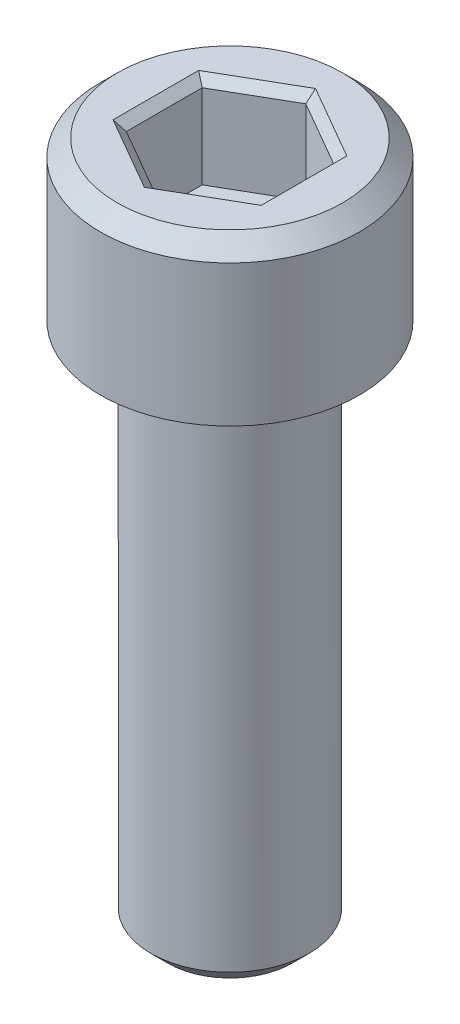
ISO-10303-21;
HEADER;
FILE_DESCRIPTION(('STEP AP214'),'2;1');
FILE_NAME('part.step','',(''),(''),'','','');
FILE_SCHEMA(('AUTOMOTIVE_DESIGN { 1 0 10303 214 1 1 1 1 }'));
ENDSEC;
DATA;
#1=APPLICATION_CONTEXT('core data for automotive mechanical design processes');
#2=APPLICATION_PROTOCOL_DEFINITION('international standard','automotive_design',2000,#1);
#3=PRODUCT_CONTEXT('',#1,'mechanical');
#4=PRODUCT('Part','Part','',(#3));
#5=PRODUCT_RELATED_PRODUCT_CATEGORY('part','',(#4));
#6=PRODUCT_DEFINITION_FORMATION('','',#4);
#7=PRODUCT_DEFINITION_CONTEXT('part definition',#1,'design');
#8=PRODUCT_DEFINITION('design','',#6,#7);
#9=PRODUCT_DEFINITION_SHAPE('','',#8);
#10=(LENGTH_UNIT() NAMED_UNIT(*) SI_UNIT(.MILLI.,.METRE.));
#11=(NAMED_UNIT(*) PLANE_ANGLE_UNIT() SI_UNIT($,.RADIAN.));
#12=(NAMED_UNIT(*) SI_UNIT($,.STERADIAN.) SOLID_ANGLE_UNIT());
#13=UNCERTAINTY_MEASURE_WITH_UNIT(LENGTH_MEASURE(1.E-05),#10,'distance_accuracy_value','');
#14=(GEOMETRIC_REPRESENTATION_CONTEXT(3) GLOBAL_UNCERTAINTY_ASSIGNED_CONTEXT((#13)) GLOBAL_UNIT_ASSIGNED_CONTEXT((#10,
#11,#12)) REPRESENTATION_CONTEXT('',''));
#15=CARTESIAN_POINT('',(0.,0.,0.));
#16=DIRECTION('',(0.,0.,1.));
#17=DIRECTION('',(1.,0.,0.));
#18=AXIS2_PLACEMENT_3D('',#15,#16,#17);
#19=CARTESIAN_POINT('',(-3.96874999999999,-2.794,0.));
#20=DIRECTION('',(0.,-1.,0.));
#21=DIRECTION('',(0.,0.,-1.));
#22=AXIS2_PLACEMENT_3D('',#19,#20,#21);
#23=PLANE('',#22);
#24=DIRECTION('',(-0.866025403784439,0.,0.5));
#25=VECTOR('',#24,1.);
#26=CARTESIAN_POINT('',(1.98437500000001,-2.794,1.14567944042317));
#27=LINE('',#26,#25);
#28=CARTESIAN_POINT('',(1.98437500000001,-2.794,1.14567944042317));
#29=VERTEX_POINT('',#28);
#30=CARTESIAN_POINT('',(0.,-2.794,2.29135888084634));
#31=VERTEX_POINT('',#30);
#32=EDGE_CURVE('E88',#29,#31,#27,.T.);
#33=ORIENTED_EDGE('',*,*,#32,.F.);
#34=DIRECTION('',(0.,0.,1.));
#35=VECTOR('',#34,1.);
#36=CARTESIAN_POINT('',(1.98437500000001,-2.794,-1.14567944042316));
#37=LINE('',#36,#35);
#38=CARTESIAN_POINT('',(1.98437500000001,-2.794,-1.14567944042316));
#39=VERTEX_POINT('',#38);
#40=EDGE_CURVE('E93',#39,#29,#37,.T.);
#41=ORIENTED_EDGE('',*,*,#40,.F.);
#42=DIRECTION('',(0.866025403784439,0.,0.5));
#43=VECTOR('',#42,1.);
#44=CARTESIAN_POINT('',(0.,-2.794,-2.29135888084632));
#45=LINE('',#44,#43);
#46=CARTESIAN_POINT('',(0.,-2.794,-2.29135888084632));
#47=VERTEX_POINT('',#46);
#48=EDGE_CURVE('E178',#47,#39,#45,.T.);
#49=ORIENTED_EDGE('',*,*,#48,.F.);
#50=DIRECTION('',(0.866025403784438,0.,-0.5));
#51=VECTOR('',#50,1.);
#52=CARTESIAN_POINT('',(-1.98437499999999,-2.794,-1.14567944042316));
#53=LINE('',#52,#51);
#54=CARTESIAN_POINT('',(-1.984375,-2.794,-1.14567944042316));
#55=VERTEX_POINT('',#54);
#56=EDGE_CURVE('E184',#55,#47,#53,.T.);
#57=ORIENTED_EDGE('',*,*,#56,.F.);
#58=DIRECTION('',(0.,0.,-1.));
#59=VECTOR('',#58,1.);
#60=CARTESIAN_POINT('',(-1.984375,-2.794,1.14567944042317));
#61=LINE('',#60,#59);
#62=CARTESIAN_POINT('',(-1.984375,-2.794,1.14567944042317));
#63=VERTEX_POINT('',#62);
#64=EDGE_CURVE('E189',#63,#55,#61,.T.);
#65=ORIENTED_EDGE('',*,*,#64,.F.);
#66=DIRECTION('',(-0.866025403784438,0.,-0.5));
#67=VECTOR('',#66,1.);
#68=CARTESIAN_POINT('',(0.,-2.794,2.29135888084634));
#69=LINE('',#68,#67);
#70=EDGE_CURVE('E104',#31,#63,#69,.T.);
#71=ORIENTED_EDGE('',*,*,#70,.F.);
#72=EDGE_LOOP('',(#33,#41,#49,#57,#65,#71));
#73=FACE_BOUND('',#72,.T.);
#74=ADVANCED_FACE('F19',(#73),#23,.F.);
#75=CARTESIAN_POINT('',(1.98437500000001,-2.794,-1.14567944042316));
#76=DIRECTION('',(-1.,0.,0.));
#77=DIRECTION('',(0.,0.,1.));
#78=AXIS2_PLACEMENT_3D('',#75,#76,#77);
#79=PLANE('',#78);
#80=DIRECTION('',(0.,1.,0.));
#81=VECTOR('',#80,1.);
#82=CARTESIAN_POINT('',(1.98437500000001,-2.794,-1.14567944042316));
#83=LINE('',#82,#81);
#84=CARTESIAN_POINT('',(1.98437500000001,-0.254,-1.14567944042316));
#85=VERTEX_POINT('',#84);
#86=EDGE_CURVE('E98',#39,#85,#83,.T.);
#87=ORIENTED_EDGE('',*,*,#86,.F.);
#88=ORIENTED_EDGE('',*,*,#40,.T.);
#89=DIRECTION('',(0.,1.,0.));
#90=VECTOR('',#89,1.);
#91=CARTESIAN_POINT('',(1.98437500000001,-2.794,1.14567944042317));
#92=LINE('',#91,#90);
#93=CARTESIAN_POINT('',(1.98437500000001,-0.254,1.14567944042317));
#94=VERTEX_POINT('',#93);
#95=EDGE_CURVE('E95',#94,#29,#92,.F.);
#96=ORIENTED_EDGE('',*,*,#95,.F.);
#97=DIRECTION('',(0.,0.,1.));
#98=VECTOR('',#97,1.);
#99=CARTESIAN_POINT('',(1.98437500000001,-0.254,0.));
#100=LINE('',#99,#98);
#101=EDGE_CURVE('E176',#94,#85,#100,.F.);
#102=ORIENTED_EDGE('',*,*,#101,.T.);
#103=EDGE_LOOP('',(#87,#88,#96,#102));
#104=FACE_BOUND('',#103,.T.);
#105=ADVANCED_FACE('F94',(#104),#79,.T.);
#106=CARTESIAN_POINT('',(1.98437500000001,-2.794,1.14567944042317));
#107=DIRECTION('',(-0.5,0.,-0.866025403784439));
#108=DIRECTION('',(-0.866025403784439,0.,0.5));
#109=AXIS2_PLACEMENT_3D('',#106,#107,#108);
#110=PLANE('',#109);
#111=ORIENTED_EDGE('',*,*,#95,.T.);
#112=ORIENTED_EDGE('',*,*,#32,.T.);
#113=DIRECTION('',(0.,1.,0.));
#114=VECTOR('',#113,1.);
#115=CARTESIAN_POINT('',(0.,-2.794,2.29135888084634));
#116=LINE('',#115,#114);
#117=CARTESIAN_POINT('',(0.,-0.253999999999999,2.29135888084634));
#118=VERTEX_POINT('',#117);
#119=EDGE_CURVE('E106',#118,#31,#116,.F.);
#120=ORIENTED_EDGE('',*,*,#119,.F.);
#121=DIRECTION('',(0.866025403784439,0.,-0.5));
#122=VECTOR('',#121,1.);
#123=CARTESIAN_POINT('',(0.,-0.253999999999998,2.29135888084634));
#124=LINE('',#123,#122);
#125=EDGE_CURVE('E110',#118,#94,#124,.T.);
#126=ORIENTED_EDGE('',*,*,#125,.T.);
#127=EDGE_LOOP('',(#111,#112,#120,#126));
#128=FACE_BOUND('',#127,.T.);
#129=ADVANCED_FACE('F108',(#128),#110,.T.);
#130=CARTESIAN_POINT('',(0.,-2.794,2.29135888084634));
#131=DIRECTION('',(0.5,0.,-0.866025403784438));
#132=DIRECTION('',(-0.866025403784438,0.,-0.5));
#133=AXIS2_PLACEMENT_3D('',#130,#131,#132);
#134=PLANE('',#133);
#135=ORIENTED_EDGE('',*,*,#119,.T.);
#136=ORIENTED_EDGE('',*,*,#70,.T.);
#137=DIRECTION('',(0.,1.,0.));
#138=VECTOR('',#137,1.);
#139=CARTESIAN_POINT('',(-1.984375,-2.794,1.14567944042317));
#140=LINE('',#139,#138);
#141=CARTESIAN_POINT('',(-1.984375,-0.254,1.14567944042317));
#142=VERTEX_POINT('',#141);
#143=EDGE_CURVE('E191',#142,#63,#140,.F.);
#144=ORIENTED_EDGE('',*,*,#143,.F.);
#145=DIRECTION('',(0.866025403784438,0.,0.500000000000001));
#146=VECTOR('',#145,1.);
#147=CARTESIAN_POINT('',(-1.984375,-0.254,1.14567944042317));
#148=LINE('',#147,#146);
#149=EDGE_CURVE('E170',#142,#118,#148,.T.);
#150=ORIENTED_EDGE('',*,*,#149,.T.);
#151=EDGE_LOOP('',(#135,#136,#144,#150));
#152=FACE_BOUND('',#151,.T.);
#153=ADVANCED_FACE('F195',(#152),#134,.T.);
#154=CARTESIAN_POINT('',(-1.984375,-2.794,1.14567944042317));
#155=DIRECTION('',(1.,0.,0.));
#156=DIRECTION('',(0.,0.,-1.));
#157=AXIS2_PLACEMENT_3D('',#154,#155,#156);
#158=PLANE('',#157);
#159=ORIENTED_EDGE('',*,*,#143,.T.);
#160=ORIENTED_EDGE('',*,*,#64,.T.);
#161=DIRECTION('',(0.,1.,0.));
#162=VECTOR('',#161,1.);
#163=CARTESIAN_POINT('',(-1.984375,-2.794,-1.14567944042316));
#164=LINE('',#163,#162);
#165=CARTESIAN_POINT('',(-1.984375,-0.253999999999999,-1.14567944042316));
#166=VERTEX_POINT('',#165);
#167=EDGE_CURVE('E186',#166,#55,#164,.F.);
#168=ORIENTED_EDGE('',*,*,#167,.F.);
#169=DIRECTION('',(0.,0.,1.));
#170=VECTOR('',#169,1.);
#171=CARTESIAN_POINT('',(-1.984375,-0.254,0.));
#172=LINE('',#171,#170);
#173=EDGE_CURVE('E165',#166,#142,#172,.T.);
#174=ORIENTED_EDGE('',*,*,#173,.T.);
#175=EDGE_LOOP('',(#159,#160,#168,#174));
#176=FACE_BOUND('',#175,.T.);
#177=ADVANCED_FACE('F225',(#176),#158,.T.);
#178=CARTESIAN_POINT('',(-1.98437499999999,-2.794,-1.14567944042316));
#179=DIRECTION('',(0.5,0.,0.866025403784438));
#180=DIRECTION('',(0.866025403784438,0.,-0.5));
#181=AXIS2_PLACEMENT_3D('',#178,#179,#180);
#182=PLANE('',#181);
#183=ORIENTED_EDGE('',*,*,#167,.T.);
#184=ORIENTED_EDGE('',*,*,#56,.T.);
#185=DIRECTION('',(0.,1.,0.));
#186=VECTOR('',#185,1.);
#187=CARTESIAN_POINT('',(0.,-2.794,-2.29135888084632));
#188=LINE('',#187,#186);
#189=CARTESIAN_POINT('',(0.,-0.254,-2.29135888084632));
#190=VERTEX_POINT('',#189);
#191=EDGE_CURVE('E180',#190,#47,#188,.F.);
#192=ORIENTED_EDGE('',*,*,#191,.F.);
#193=DIRECTION('',(-0.866025403784439,0.,0.499999999999999));
#194=VECTOR('',#193,1.);
#195=CARTESIAN_POINT('',(0.,-0.253999999999999,-2.29135888084632));
#196=LINE('',#195,#194);
#197=EDGE_CURVE('E160',#190,#166,#196,.T.);
#198=ORIENTED_EDGE('',*,*,#197,.T.);
#199=EDGE_LOOP('',(#183,#184,#192,#198));
#200=FACE_BOUND('',#199,.T.);
#201=ADVANCED_FACE('F221',(#200),#182,.T.);
#202=CARTESIAN_POINT('',(0.,-2.794,-2.29135888084632));
#203=DIRECTION('',(-0.5,0.,0.866025403784439));
#204=DIRECTION('',(0.866025403784439,0.,0.5));
#205=AXIS2_PLACEMENT_3D('',#202,#203,#204);
#206=PLANE('',#205);
#207=ORIENTED_EDGE('',*,*,#191,.T.);
#208=ORIENTED_EDGE('',*,*,#48,.T.);
#209=ORIENTED_EDGE('',*,*,#86,.T.);
#210=DIRECTION('',(-0.866025403784439,0.,-0.499999999999999));
#211=VECTOR('',#210,1.);
#212=CARTESIAN_POINT('',(1.98437500000001,-0.253999999999997,-1.14567944042316));
#213=LINE('',#212,#211);
#214=EDGE_CURVE('E152',#85,#190,#213,.T.);
#215=ORIENTED_EDGE('',*,*,#214,.T.);
#216=EDGE_LOOP('',(#207,#208,#209,#215));
#217=FACE_BOUND('',#216,.T.);
#218=ADVANCED_FACE('F216',(#217),#206,.T.);
#219=CARTESIAN_POINT('',(2.23837500000001,0.,0.));
#220=DIRECTION('',(0.707106781186548,-0.707106781186548,0.));
#221=DIRECTION('',(0.707106781186548,0.707106781186548,0.));
#222=AXIS2_PLACEMENT_3D('',#219,#220,#221);
#223=PLANE('',#222);
#224=ORIENTED_EDGE('',*,*,#101,.F.);
#225=DIRECTION('',(0.654653670707971,0.654653670707979,0.377964473009234));
#226=VECTOR('',#225,1.);
#227=CARTESIAN_POINT('',(1.98437500000001,-0.254,1.14567944042317));
#228=LINE('',#227,#226);
#229=CARTESIAN_POINT('',(2.23837500000001,0.,1.29232640879734));
#230=VERTEX_POINT('',#229);
#231=EDGE_CURVE('E173',#94,#230,#228,.T.);
#232=ORIENTED_EDGE('',*,*,#231,.T.);
#233=DIRECTION('',(0.,0.,1.));
#234=VECTOR('',#233,1.);
#235=CARTESIAN_POINT('',(2.23837500000001,0.,0.));
#236=LINE('',#235,#234);
#237=CARTESIAN_POINT('',(2.23837500000001,0.,-1.29232640879732));
#238=VERTEX_POINT('',#237);
#239=EDGE_CURVE('E148',#238,#230,#236,.T.);
#240=ORIENTED_EDGE('',*,*,#239,.F.);
#241=DIRECTION('',(-0.654653670707983,-0.654653670707975,0.377964473009222));
#242=VECTOR('',#241,1.);
#243=CARTESIAN_POINT('',(2.23837500000001,0.,-1.29232640879732));
#244=LINE('',#243,#242);
#245=EDGE_CURVE('E155',#238,#85,#244,.T.);
#246=ORIENTED_EDGE('',*,*,#245,.T.);
#247=EDGE_LOOP('',(#224,#232,#240,#246));
#248=FACE_BOUND('',#247,.T.);
#249=ADVANCED_FACE('F211',(#248),#223,.F.);
#250=CARTESIAN_POINT('',(1.11918750000001,0.,1.938489613196));
#251=DIRECTION('',(0.353553390593273,-0.707106781186548,0.612372435695794));
#252=DIRECTION('',(0.,-0.654653670707977,-0.755928946018455));
#253=AXIS2_PLACEMENT_3D('',#250,#251,#252);
#254=PLANE('',#253);
#255=ORIENTED_EDGE('',*,*,#125,.F.);
#256=DIRECTION('',(0.,-0.654653670707977,-0.755928946018455));
#257=VECTOR('',#256,1.);
#258=CARTESIAN_POINT('',(0.,-0.319767857142859,2.21541670079543));
#259=LINE('',#258,#257);
#260=CARTESIAN_POINT('',(0.,0.,2.58465281759467));
#261=VERTEX_POINT('',#260);
#262=EDGE_CURVE('E168',#118,#261,#259,.F.);
#263=ORIENTED_EDGE('',*,*,#262,.T.);
#264=DIRECTION('',(-0.866025403784439,0.,0.5));
#265=VECTOR('',#264,1.);
#266=CARTESIAN_POINT('',(2.23837500000001,0.,1.29232640879734));
#267=LINE('',#266,#265);
#268=EDGE_CURVE('E145',#230,#261,#267,.T.);
#269=ORIENTED_EDGE('',*,*,#268,.F.);
#270=ORIENTED_EDGE('',*,*,#231,.F.);
#271=EDGE_LOOP('',(#255,#263,#269,#270));
#272=FACE_BOUND('',#271,.T.);
#273=ADVANCED_FACE('F202',(#272),#254,.F.);
#274=CARTESIAN_POINT('',(-1.1191875,0.,1.938489613196));
#275=DIRECTION('',(-0.353553390593274,-0.707106781186548,0.612372435695794));
#276=DIRECTION('',(0.,-0.654653670707977,-0.755928946018455));
#277=AXIS2_PLACEMENT_3D('',#274,#275,#276);
#278=PLANE('',#277);
#279=DIRECTION('',(-0.866025403784437,0.,-0.500000000000002));
#280=VECTOR('',#279,1.);
#281=CARTESIAN_POINT('',(0.,0.,2.58465281759467));
#282=LINE('',#281,#280);
#283=CARTESIAN_POINT('',(-2.238375,0.,1.29232640879733));
#284=VERTEX_POINT('',#283);
#285=EDGE_CURVE('E142',#261,#284,#282,.T.);
#286=ORIENTED_EDGE('',*,*,#285,.F.);
#287=ORIENTED_EDGE('',*,*,#262,.F.);
#288=ORIENTED_EDGE('',*,*,#149,.F.);
#289=DIRECTION('',(-0.65465367070798,0.65465367070798,0.377964473009216));
#290=VECTOR('',#289,1.);
#291=CARTESIAN_POINT('',(-1.984375,-0.254,1.14567944042317));
#292=LINE('',#291,#290);
#293=EDGE_CURVE('E163',#142,#284,#292,.T.);
#294=ORIENTED_EDGE('',*,*,#293,.T.);
#295=EDGE_LOOP('',(#286,#287,#288,#294));
#296=FACE_BOUND('',#295,.T.);
#297=ADVANCED_FACE('F205',(#296),#278,.F.);
#298=CARTESIAN_POINT('',(-2.238375,0.,0.));
#299=DIRECTION('',(-0.707106781186548,-0.707106781186548,0.));
#300=DIRECTION('',(0.707106781186548,-0.707106781186548,0.));
#301=AXIS2_PLACEMENT_3D('',#298,#299,#300);
#302=PLANE('',#301);
#303=DIRECTION('',(0.,0.,1.));
#304=VECTOR('',#303,1.);
#305=CARTESIAN_POINT('',(-2.238375,0.,0.));
#306=LINE('',#305,#304);
#307=CARTESIAN_POINT('',(-2.238375,0.,-1.29232640879732));
#308=VERTEX_POINT('',#307);
#309=EDGE_CURVE('E139',#284,#308,#306,.F.);
#310=ORIENTED_EDGE('',*,*,#309,.F.);
#311=ORIENTED_EDGE('',*,*,#293,.F.);
#312=ORIENTED_EDGE('',*,*,#173,.F.);
#313=DIRECTION('',(-0.654653670707983,0.654653670707975,-0.377964473009222));
#314=VECTOR('',#313,1.);
#315=CARTESIAN_POINT('',(-1.984375,-0.253999999999995,-1.14567944042316));
#316=LINE('',#315,#314);
#317=EDGE_CURVE('E158',#166,#308,#316,.T.);
#318=ORIENTED_EDGE('',*,*,#317,.T.);
#319=EDGE_LOOP('',(#310,#311,#312,#318));
#320=FACE_BOUND('',#319,.T.);
#321=ADVANCED_FACE('F223',(#320),#302,.F.);
#322=CARTESIAN_POINT('',(-1.1191875,0.,-1.93848961319598));
#323=DIRECTION('',(-0.353553390593274,-0.707106781186548,-0.612372435695794));
#324=DIRECTION('',(0.,0.654653670707977,-0.755928946018455));
#325=AXIS2_PLACEMENT_3D('',#322,#323,#324);
#326=PLANE('',#325);
#327=ORIENTED_EDGE('',*,*,#197,.F.);
#328=DIRECTION('',(0.,0.654653670707977,-0.755928946018455));
#329=VECTOR('',#328,1.);
#330=CARTESIAN_POINT('',(0.,-0.319767857142856,-2.21541670079542));
#331=LINE('',#330,#329);
#332=CARTESIAN_POINT('',(0.,0.,-2.58465281759465));
#333=VERTEX_POINT('',#332);
#334=EDGE_CURVE('E37',#190,#333,#331,.T.);
#335=ORIENTED_EDGE('',*,*,#334,.T.);
#336=DIRECTION('',(0.866025403784439,0.,-0.499999999999999));
#337=VECTOR('',#336,1.);
#338=CARTESIAN_POINT('',(-2.238375,0.,-1.29232640879732));
#339=LINE('',#338,#337);
#340=EDGE_CURVE('E136',#308,#333,#339,.T.);
#341=ORIENTED_EDGE('',*,*,#340,.F.);
#342=ORIENTED_EDGE('',*,*,#317,.F.);
#343=EDGE_LOOP('',(#327,#335,#341,#342));
#344=FACE_BOUND('',#343,.T.);
#345=ADVANCED_FACE('F218',(#344),#326,.F.);
#346=CARTESIAN_POINT('',(1.1191875,0.,-1.93848961319599));
#347=DIRECTION('',(0.353553390593274,-0.707106781186548,-0.612372435695794));
#348=DIRECTION('',(0.,0.654653670707977,-0.755928946018455));
#349=AXIS2_PLACEMENT_3D('',#346,#347,#348);
#350=PLANE('',#349);
#351=ORIENTED_EDGE('',*,*,#214,.F.);
#352=ORIENTED_EDGE('',*,*,#245,.F.);
#353=DIRECTION('',(0.866025403784439,0.,0.5));
#354=VECTOR('',#353,1.);
#355=CARTESIAN_POINT('',(0.,0.,-2.58465281759465));
#356=LINE('',#355,#354);
#357=EDGE_CURVE('E127',#333,#238,#356,.T.);
#358=ORIENTED_EDGE('',*,*,#357,.F.);
#359=ORIENTED_EDGE('',*,*,#334,.F.);
#360=EDGE_LOOP('',(#351,#352,#358,#359));
#361=FACE_BOUND('',#360,.T.);
#362=ADVANCED_FACE('F214',(#361),#350,.F.);
#363=CARTESIAN_POINT('',(0.,0.,0.));
#364=DIRECTION('',(0.,1.,0.));
#365=DIRECTION('',(0.,0.,1.));
#366=AXIS2_PLACEMENT_3D('',#363,#364,#365);
#367=PLANE('',#366);
#368=CARTESIAN_POINT('',(0.,0.,0.));
#369=DIRECTION('',(0.,-1.,0.));
#370=DIRECTION('',(0.,0.,-1.));
#371=AXIS2_PLACEMENT_3D('',#368,#369,#370);
#372=CIRCLE('',#371,3.40360000006967);
#373=CARTESIAN_POINT('',(0.,0.,-3.40360000006967));
#374=VERTEX_POINT('',#373);
#375=EDGE_CURVE('E22',#374,#374,#372,.T.);
#376=ORIENTED_EDGE('',*,*,#375,.F.);
#377=EDGE_LOOP('',(#376));
#378=FACE_BOUND('',#377,.T.);
#379=ORIENTED_EDGE('',*,*,#340,.T.);
#380=ORIENTED_EDGE('',*,*,#357,.T.);
#381=ORIENTED_EDGE('',*,*,#239,.T.);
#382=ORIENTED_EDGE('',*,*,#268,.T.);
#383=ORIENTED_EDGE('',*,*,#285,.T.);
#384=ORIENTED_EDGE('',*,*,#309,.T.);
#385=EDGE_LOOP('',(#379,#380,#381,#382,#383,#384));
#386=FACE_BOUND('',#385,.T.);
#387=ADVANCED_FACE('F208',(#378,#386),#367,.T.);
#388=CARTESIAN_POINT('',(0.,-0.507999999967979,0.));
#389=DIRECTION('',(0.,-1.,0.));
#390=DIRECTION('',(0.,0.,-1.));
#391=AXIS2_PLACEMENT_3D('',#388,#389,#390);
#392=CONICAL_SURFACE('',#391,3.91160000003765,0.785398163397448);
#393=ORIENTED_EDGE('',*,*,#375,.T.);
#394=EDGE_LOOP('',(#393));
#395=FACE_BOUND('',#394,.T.);
#396=CARTESIAN_POINT('',(0.,-0.508,0.));
#397=DIRECTION('',(0.,-1.,0.));
#398=DIRECTION('',(0.,0.,-1.));
#399=AXIS2_PLACEMENT_3D('',#396,#397,#398);
#400=CIRCLE('',#399,3.9116);
#401=CARTESIAN_POINT('',(0.,-0.508,-3.9116));
#402=VERTEX_POINT('',#401);
#403=EDGE_CURVE('E119',#402,#402,#400,.T.);
#404=ORIENTED_EDGE('',*,*,#403,.F.);
#405=EDGE_LOOP('',(#404));
#406=FACE_BOUND('',#405,.T.);
#407=ADVANCED_FACE('F259',(#395,#406),#392,.T.);
#408=CARTESIAN_POINT('',(0.,-20.6502,0.));
#409=DIRECTION('',(0.,1.,0.));
#410=DIRECTION('',(0.,0.,1.));
#411=AXIS2_PLACEMENT_3D('',#408,#409,#410);
#412=PLANE('',#411);
#413=CARTESIAN_POINT('',(0.,-20.6502000000341,0.));
#414=DIRECTION('',(0.,1.,0.));
#415=DIRECTION('',(0.,0.,1.));
#416=AXIS2_PLACEMENT_3D('',#413,#414,#415);
#417=CIRCLE('',#416,1.87959999999521);
#418=CARTESIAN_POINT('',(0.,-20.6502000000341,1.87959999999521));
#419=VERTEX_POINT('',#418);
#420=EDGE_CURVE('E117',#419,#419,#417,.T.);
#421=ORIENTED_EDGE('',*,*,#420,.F.);
#422=EDGE_LOOP('',(#421));
#423=FACE_BOUND('',#422,.T.);
#424=ADVANCED_FACE('F255',(#423),#412,.F.);
#425=CARTESIAN_POINT('',(0.,-4.7752,0.));
#426=DIRECTION('',(0.,-1.,0.));
#427=DIRECTION('',(0.,0.,-1.));
#428=AXIS2_PLACEMENT_3D('',#425,#426,#427);
#429=CYLINDRICAL_SURFACE('',#428,3.9116);
#430=CARTESIAN_POINT('',(0.,-4.7752,0.));
#431=DIRECTION('',(0.,-1.,0.));
#432=DIRECTION('',(0.,0.,-1.));
#433=AXIS2_PLACEMENT_3D('',#430,#431,#432);
#434=CIRCLE('',#433,3.9116);
#435=CARTESIAN_POINT('',(0.,-4.7752,-3.9116));
#436=VERTEX_POINT('',#435);
#437=EDGE_CURVE('E115',#436,#436,#434,.F.);
#438=ORIENTED_EDGE('',*,*,#437,.T.);
#439=EDGE_LOOP('',(#438));
#440=FACE_BOUND('',#439,.T.);
#441=ORIENTED_EDGE('',*,*,#403,.T.);
#442=EDGE_LOOP('',(#441));
#443=FACE_BOUND('',#442,.T.);
#444=ADVANCED_FACE('F251',(#440,#443),#429,.T.);
#445=CARTESIAN_POINT('',(0.,-20.1422000000662,0.));
#446=DIRECTION('',(0.,1.,0.));
#447=DIRECTION('',(0.,0.,1.));
#448=AXIS2_PLACEMENT_3D('',#445,#446,#447);
#449=CONICAL_SURFACE('',#448,2.38759999996319,0.785398163397448);
#450=CARTESIAN_POINT('',(0.,-20.1422,0.));
#451=DIRECTION('',(0.,-1.,0.));
#452=DIRECTION('',(0.,0.,-1.));
#453=AXIS2_PLACEMENT_3D('',#450,#451,#452);
#454=CIRCLE('',#453,2.3876);
#455=CARTESIAN_POINT('',(0.,-20.1422,-2.3876));
#456=VERTEX_POINT('',#455);
#457=EDGE_CURVE('E28',#456,#456,#454,.F.);
#458=ORIENTED_EDGE('',*,*,#457,.F.);
#459=EDGE_LOOP('',(#458));
#460=FACE_BOUND('',#459,.T.);
#461=ORIENTED_EDGE('',*,*,#420,.T.);
#462=EDGE_LOOP('',(#461));
#463=FACE_BOUND('',#462,.T.);
#464=ADVANCED_FACE('F244',(#460,#463),#449,.T.);
#465=CARTESIAN_POINT('',(0.,-4.7752,0.));
#466=DIRECTION('',(0.,1.,0.));
#467=DIRECTION('',(0.,0.,1.));
#468=AXIS2_PLACEMENT_3D('',#465,#466,#467);
#469=PLANE('',#468);
#470=ORIENTED_EDGE('',*,*,#437,.F.);
#471=EDGE_LOOP('',(#470));
#472=FACE_BOUND('',#471,.T.);
#473=CARTESIAN_POINT('',(0.,-4.7752,0.));
#474=DIRECTION('',(0.,-1.,0.));
#475=DIRECTION('',(0.,0.,-1.));
#476=AXIS2_PLACEMENT_3D('',#473,#474,#475);
#477=CIRCLE('',#476,2.3876);
#478=CARTESIAN_POINT('',(0.,-4.7752,-2.3876));
#479=VERTEX_POINT('',#478);
#480=EDGE_CURVE('E11',#479,#479,#477,.T.);
#481=ORIENTED_EDGE('',*,*,#480,.F.);
#482=EDGE_LOOP('',(#481));
#483=FACE_BOUND('',#482,.T.);
#484=ADVANCED_FACE('F238',(#472,#483),#469,.F.);
#485=CARTESIAN_POINT('',(0.,-20.6502,0.));
#486=DIRECTION('',(0.,-1.,0.));
#487=DIRECTION('',(0.,0.,-1.));
#488=AXIS2_PLACEMENT_3D('',#485,#486,#487);
#489=CYLINDRICAL_SURFACE('',#488,2.3876);
#490=ORIENTED_EDGE('',*,*,#480,.T.);
#491=EDGE_LOOP('',(#490));
#492=FACE_BOUND('',#491,.T.);
#493=ORIENTED_EDGE('',*,*,#457,.T.);
#494=EDGE_LOOP('',(#493));
#495=FACE_BOUND('',#494,.T.);
#496=ADVANCED_FACE('F236',(#492,#495),#489,.T.);
#497=CLOSED_SHELL('',(#74,#105,#129,#153,#177,#201,#218,#249,#273,#297,#321,#345,#362,#387,#407,
#424,#444,#464,#484,#496));
#498=MANIFOLD_SOLID_BREP('B1',#497);
#499=ADVANCED_BREP_SHAPE_REPRESENTATION('',(#18,#498),#14);
#500=SHAPE_DEFINITION_REPRESENTATION(#9,#499);
ENDSEC;
END-ISO-10303-21;
